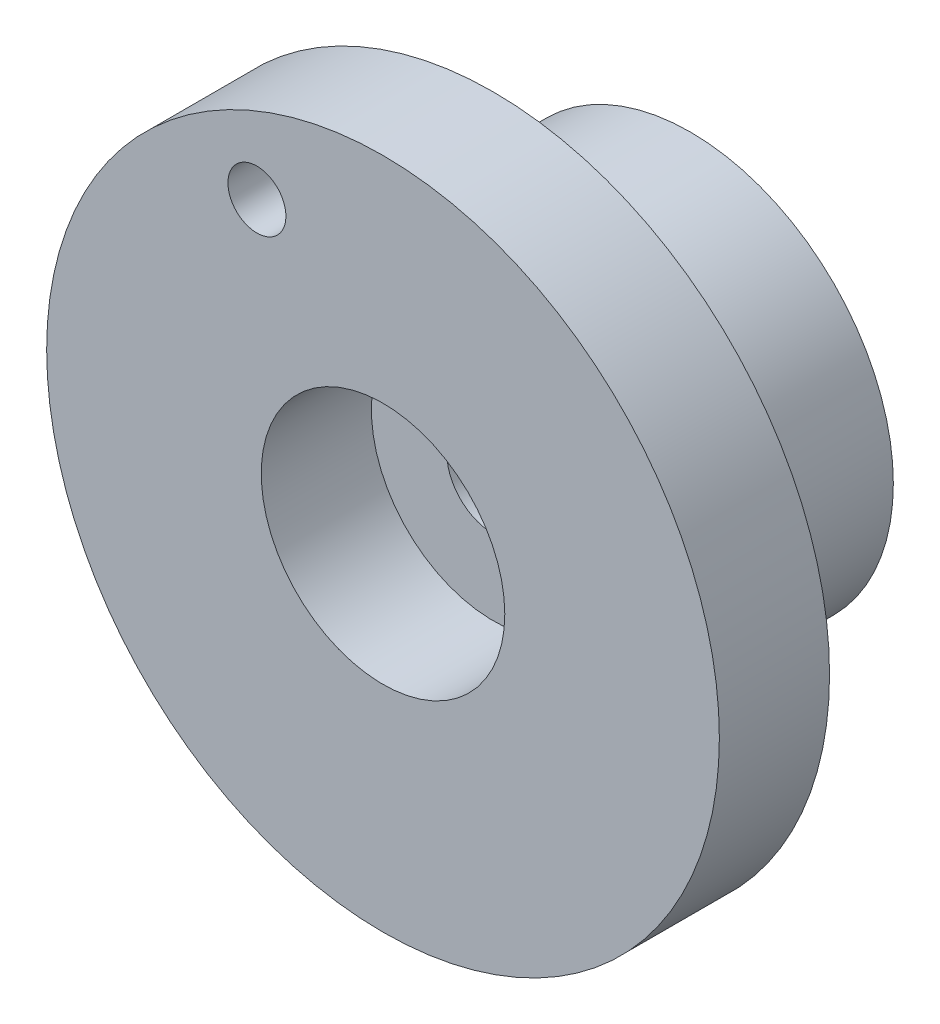
ISO-10303-21;
HEADER;
FILE_DESCRIPTION(('STEP AP214'),'2;1');
FILE_NAME('part.step','',(''),(''),'','','');
FILE_SCHEMA(('AUTOMOTIVE_DESIGN { 1 0 10303 214 1 1 1 1 }'));
ENDSEC;
DATA;
#1=APPLICATION_CONTEXT('core data for automotive mechanical design processes');
#2=APPLICATION_PROTOCOL_DEFINITION('international standard','automotive_design',2000,#1);
#3=PRODUCT_CONTEXT('',#1,'mechanical');
#4=PRODUCT('Part','Part','',(#3));
#5=PRODUCT_RELATED_PRODUCT_CATEGORY('part','',(#4));
#6=PRODUCT_DEFINITION_FORMATION('','',#4);
#7=PRODUCT_DEFINITION_CONTEXT('part definition',#1,'design');
#8=PRODUCT_DEFINITION('design','',#6,#7);
#9=PRODUCT_DEFINITION_SHAPE('','',#8);
#10=(LENGTH_UNIT() NAMED_UNIT(*) SI_UNIT(.MILLI.,.METRE.));
#11=(NAMED_UNIT(*) PLANE_ANGLE_UNIT() SI_UNIT($,.RADIAN.));
#12=(NAMED_UNIT(*) SI_UNIT($,.STERADIAN.) SOLID_ANGLE_UNIT());
#13=UNCERTAINTY_MEASURE_WITH_UNIT(LENGTH_MEASURE(1.E-05),#10,'distance_accuracy_value','');
#14=(GEOMETRIC_REPRESENTATION_CONTEXT(3) GLOBAL_UNCERTAINTY_ASSIGNED_CONTEXT((#13)) GLOBAL_UNIT_ASSIGNED_CONTEXT((#10,
#11,#12)) REPRESENTATION_CONTEXT('',''));
#15=CARTESIAN_POINT('',(0.,0.,0.));
#16=DIRECTION('',(0.,0.,1.));
#17=DIRECTION('',(1.,0.,0.));
#18=AXIS2_PLACEMENT_3D('',#15,#16,#17);
#19=CARTESIAN_POINT('',(0.,0.,9.5));
#20=DIRECTION('',(0.,0.,1.));
#21=DIRECTION('',(1.,0.,0.));
#22=AXIS2_PLACEMENT_3D('',#19,#20,#21);
#23=PLANE('',#22);
#24=CARTESIAN_POINT('',(-10.8717131375547,20.2683460956912,9.5));
#25=DIRECTION('',(0.,0.,1.));
#26=DIRECTION('',(1.,0.,0.));
#27=AXIS2_PLACEMENT_3D('',#24,#25,#26);
#28=CIRCLE('',#27,2.5);
#29=CARTESIAN_POINT('',(-8.37171313755475,20.2683460956912,9.5));
#30=VERTEX_POINT('',#29);
#31=EDGE_CURVE('E77',#30,#30,#28,.T.);
#32=ORIENTED_EDGE('',*,*,#31,.F.);
#33=EDGE_LOOP('',(#32));
#34=FACE_BOUND('',#33,.T.);
#35=CARTESIAN_POINT('',(0.,0.,9.5));
#36=DIRECTION('',(0.,0.,1.));
#37=DIRECTION('',(1.,0.,0.));
#38=AXIS2_PLACEMENT_3D('',#35,#36,#37);
#39=CIRCLE('',#38,29.);
#40=CARTESIAN_POINT('',(29.,0.,9.5));
#41=VERTEX_POINT('',#40);
#42=EDGE_CURVE('E46',#41,#41,#39,.T.);
#43=ORIENTED_EDGE('',*,*,#42,.T.);
#44=EDGE_LOOP('',(#43));
#45=FACE_BOUND('',#44,.T.);
#46=CARTESIAN_POINT('',(0.,0.,9.5));
#47=DIRECTION('',(0.,0.,1.));
#48=DIRECTION('',(1.,0.,0.));
#49=AXIS2_PLACEMENT_3D('',#46,#47,#48);
#50=CIRCLE('',#49,10.5);
#51=CARTESIAN_POINT('',(10.5,0.,9.5));
#52=VERTEX_POINT('',#51);
#53=EDGE_CURVE('E56',#52,#52,#50,.T.);
#54=ORIENTED_EDGE('',*,*,#53,.F.);
#55=EDGE_LOOP('',(#54));
#56=FACE_BOUND('',#55,.T.);
#57=ADVANCED_FACE('F37',(#34,#45,#56),#23,.T.);
#58=CARTESIAN_POINT('',(0.,0.,0.));
#59=DIRECTION('',(0.,0.,1.));
#60=DIRECTION('',(1.,0.,0.));
#61=AXIS2_PLACEMENT_3D('',#58,#59,#60);
#62=PLANE('',#61);
#63=CARTESIAN_POINT('',(-10.8717131375547,20.2683460956912,0.));
#64=DIRECTION('',(0.,0.,1.));
#65=DIRECTION('',(1.,0.,0.));
#66=AXIS2_PLACEMENT_3D('',#63,#64,#65);
#67=CIRCLE('',#66,2.5);
#68=CARTESIAN_POINT('',(-8.37171313755475,20.2683460956912,0.));
#69=VERTEX_POINT('',#68);
#70=EDGE_CURVE('E41',#69,#69,#67,.T.);
#71=ORIENTED_EDGE('',*,*,#70,.T.);
#72=EDGE_LOOP('',(#71));
#73=FACE_BOUND('',#72,.T.);
#74=CARTESIAN_POINT('',(0.,0.,0.));
#75=DIRECTION('',(0.,0.,1.));
#76=DIRECTION('',(1.,0.,0.));
#77=AXIS2_PLACEMENT_3D('',#74,#75,#76);
#78=CIRCLE('',#77,17.5);
#79=CARTESIAN_POINT('',(17.5,0.,0.));
#80=VERTEX_POINT('',#79);
#81=EDGE_CURVE('E10',#80,#80,#78,.F.);
#82=ORIENTED_EDGE('',*,*,#81,.F.);
#83=EDGE_LOOP('',(#82));
#84=FACE_BOUND('',#83,.T.);
#85=CARTESIAN_POINT('',(0.,0.,0.));
#86=DIRECTION('',(0.,0.,1.));
#87=DIRECTION('',(1.,0.,0.));
#88=AXIS2_PLACEMENT_3D('',#85,#86,#87);
#89=CIRCLE('',#88,29.);
#90=CARTESIAN_POINT('',(29.,0.,0.));
#91=VERTEX_POINT('',#90);
#92=EDGE_CURVE('E51',#91,#91,#89,.T.);
#93=ORIENTED_EDGE('',*,*,#92,.F.);
#94=EDGE_LOOP('',(#93));
#95=FACE_BOUND('',#94,.T.);
#96=ADVANCED_FACE('F86',(#73,#84,#95),#62,.F.);
#97=CARTESIAN_POINT('',(0.,0.,9.5));
#98=DIRECTION('',(0.,0.,-1.));
#99=DIRECTION('',(-1.,0.,0.));
#100=AXIS2_PLACEMENT_3D('',#97,#98,#99);
#101=CYLINDRICAL_SURFACE('',#100,29.);
#102=ORIENTED_EDGE('',*,*,#42,.F.);
#103=EDGE_LOOP('',(#102));
#104=FACE_BOUND('',#103,.T.);
#105=ORIENTED_EDGE('',*,*,#92,.T.);
#106=EDGE_LOOP('',(#105));
#107=FACE_BOUND('',#106,.T.);
#108=ADVANCED_FACE('F39',(#104,#107),#101,.T.);
#109=CARTESIAN_POINT('',(0.,0.,9.5));
#110=DIRECTION('',(0.,0.,-1.));
#111=DIRECTION('',(-1.,0.,0.));
#112=AXIS2_PLACEMENT_3D('',#109,#110,#111);
#113=CYLINDRICAL_SURFACE('',#112,10.5);
#114=ORIENTED_EDGE('',*,*,#53,.T.);
#115=EDGE_LOOP('',(#114));
#116=FACE_BOUND('',#115,.T.);
#117=CARTESIAN_POINT('',(0.,0.,0.));
#118=DIRECTION('',(0.,0.,1.));
#119=DIRECTION('',(1.,0.,0.));
#120=AXIS2_PLACEMENT_3D('',#117,#118,#119);
#121=CIRCLE('',#120,10.5);
#122=CARTESIAN_POINT('',(10.5,0.,0.));
#123=VERTEX_POINT('',#122);
#124=EDGE_CURVE('E58',#123,#123,#121,.T.);
#125=ORIENTED_EDGE('',*,*,#124,.F.);
#126=EDGE_LOOP('',(#125));
#127=FACE_BOUND('',#126,.T.);
#128=ADVANCED_FACE('F107',(#116,#127),#113,.F.);
#129=CARTESIAN_POINT('',(0.,0.,0.));
#130=DIRECTION('',(0.,0.,-1.));
#131=DIRECTION('',(-1.,0.,0.));
#132=AXIS2_PLACEMENT_3D('',#129,#130,#131);
#133=PLANE('',#132);
#134=CARTESIAN_POINT('',(0.,0.,0.));
#135=DIRECTION('',(0.,0.,-1.));
#136=DIRECTION('',(-1.,0.,0.));
#137=AXIS2_PLACEMENT_3D('',#134,#135,#136);
#138=CIRCLE('',#137,4.);
#139=CARTESIAN_POINT('',(-4.,0.,0.));
#140=VERTEX_POINT('',#139);
#141=EDGE_CURVE('E70',#140,#140,#138,.T.);
#142=ORIENTED_EDGE('',*,*,#141,.T.);
#143=EDGE_LOOP('',(#142));
#144=FACE_BOUND('',#143,.T.);
#145=ORIENTED_EDGE('',*,*,#124,.T.);
#146=EDGE_LOOP('',(#145));
#147=FACE_BOUND('',#146,.T.);
#148=ADVANCED_FACE('F110',(#144,#147),#133,.F.);
#149=CARTESIAN_POINT('',(0.,0.,-17.));
#150=DIRECTION('',(0.,0.,-1.));
#151=DIRECTION('',(-1.,0.,0.));
#152=AXIS2_PLACEMENT_3D('',#149,#150,#151);
#153=PLANE('',#152);
#154=CARTESIAN_POINT('',(0.,0.,-17.));
#155=DIRECTION('',(0.,0.,-1.));
#156=DIRECTION('',(-1.,0.,0.));
#157=AXIS2_PLACEMENT_3D('',#154,#155,#156);
#158=CIRCLE('',#157,17.5);
#159=CARTESIAN_POINT('',(-17.5,0.,-17.));
#160=VERTEX_POINT('',#159);
#161=EDGE_CURVE('E62',#160,#160,#158,.T.);
#162=ORIENTED_EDGE('',*,*,#161,.T.);
#163=EDGE_LOOP('',(#162));
#164=FACE_BOUND('',#163,.T.);
#165=CARTESIAN_POINT('',(0.,0.,-17.));
#166=DIRECTION('',(0.,0.,-1.));
#167=DIRECTION('',(-1.,0.,0.));
#168=AXIS2_PLACEMENT_3D('',#165,#166,#167);
#169=CIRCLE('',#168,4.);
#170=CARTESIAN_POINT('',(-4.,0.,-17.));
#171=VERTEX_POINT('',#170);
#172=EDGE_CURVE('E69',#171,#171,#169,.T.);
#173=ORIENTED_EDGE('',*,*,#172,.F.);
#174=EDGE_LOOP('',(#173));
#175=FACE_BOUND('',#174,.T.);
#176=ADVANCED_FACE('F114',(#164,#175),#153,.T.);
#177=CARTESIAN_POINT('',(0.,0.,-17.));
#178=DIRECTION('',(0.,0.,1.));
#179=DIRECTION('',(1.,0.,0.));
#180=AXIS2_PLACEMENT_3D('',#177,#178,#179);
#181=CYLINDRICAL_SURFACE('',#180,17.5);
#182=ORIENTED_EDGE('',*,*,#161,.F.);
#183=EDGE_LOOP('',(#182));
#184=FACE_BOUND('',#183,.T.);
#185=ORIENTED_EDGE('',*,*,#81,.T.);
#186=EDGE_LOOP('',(#185));
#187=FACE_BOUND('',#186,.T.);
#188=ADVANCED_FACE('F96',(#184,#187),#181,.T.);
#189=CARTESIAN_POINT('',(0.,0.,-17.));
#190=DIRECTION('',(0.,0.,1.));
#191=DIRECTION('',(1.,0.,0.));
#192=AXIS2_PLACEMENT_3D('',#189,#190,#191);
#193=CYLINDRICAL_SURFACE('',#192,4.);
#194=ORIENTED_EDGE('',*,*,#172,.T.);
#195=EDGE_LOOP('',(#194));
#196=FACE_BOUND('',#195,.T.);
#197=ORIENTED_EDGE('',*,*,#141,.F.);
#198=EDGE_LOOP('',(#197));
#199=FACE_BOUND('',#198,.T.);
#200=ADVANCED_FACE('F91',(#196,#199),#193,.F.);
#201=CARTESIAN_POINT('',(-10.8717131375547,20.2683460956912,-7.5));
#202=DIRECTION('',(0.,0.,1.));
#203=DIRECTION('',(1.,0.,0.));
#204=AXIS2_PLACEMENT_3D('',#201,#202,#203);
#205=CYLINDRICAL_SURFACE('',#204,2.5);
#206=ORIENTED_EDGE('',*,*,#31,.T.);
#207=EDGE_LOOP('',(#206));
#208=FACE_BOUND('',#207,.T.);
#209=ORIENTED_EDGE('',*,*,#70,.F.);
#210=EDGE_LOOP('',(#209));
#211=FACE_BOUND('',#210,.T.);
#212=ADVANCED_FACE('F89',(#208,#211),#205,.F.);
#213=CLOSED_SHELL('',(#57,#96,#108,#128,#148,#176,#188,#200,#212));
#214=MANIFOLD_SOLID_BREP('B2',#213);
#215=ADVANCED_BREP_SHAPE_REPRESENTATION('',(#18,#214),#14);
#216=SHAPE_DEFINITION_REPRESENTATION(#9,#215);
ENDSEC;
END-ISO-10303-21;
